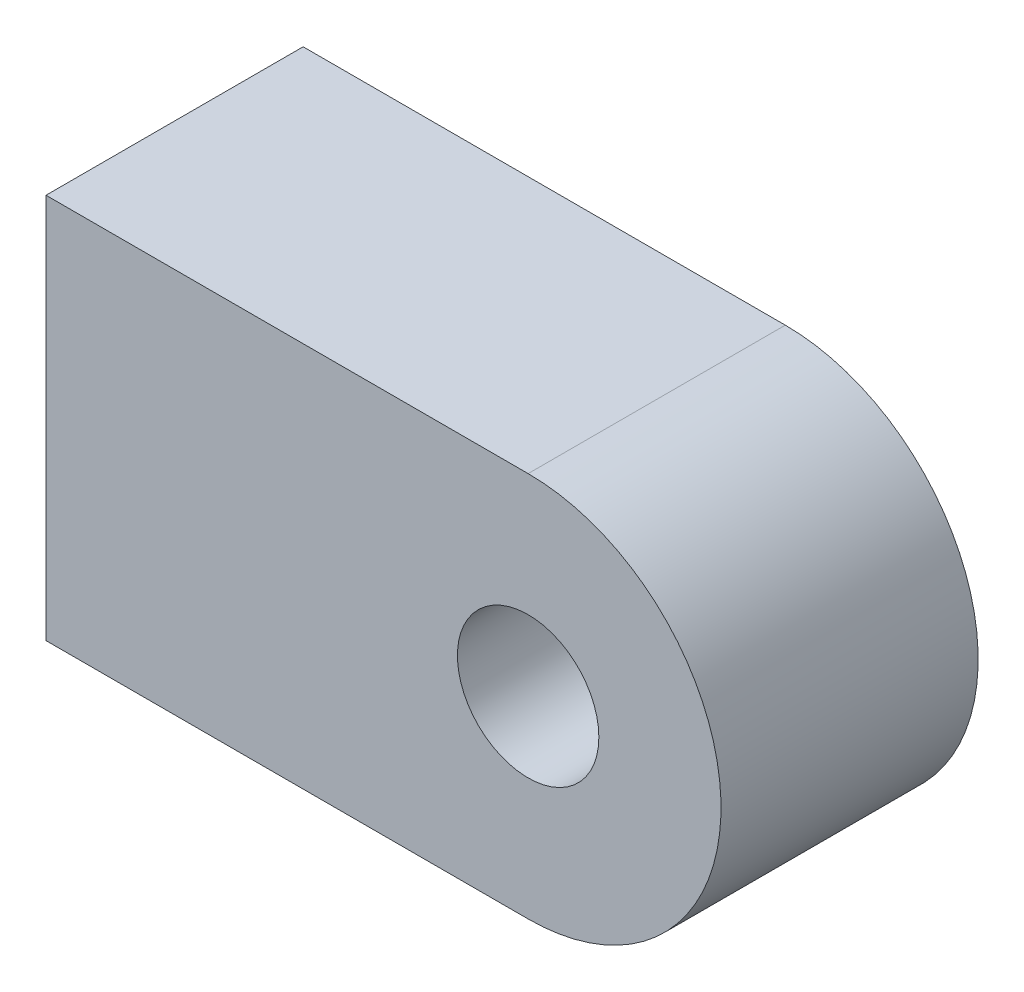
ISO-10303-21;
HEADER;
FILE_DESCRIPTION(('STEP AP214'),'2;1');
FILE_NAME('part.step','',(''),(''),'','','');
FILE_SCHEMA(('AUTOMOTIVE_DESIGN { 1 0 10303 214 1 1 1 1 }'));
ENDSEC;
DATA;
#1=APPLICATION_CONTEXT('core data for automotive mechanical design processes');
#2=APPLICATION_PROTOCOL_DEFINITION('international standard','automotive_design',2000,#1);
#3=PRODUCT_CONTEXT('',#1,'mechanical');
#4=PRODUCT('Part','Part','',(#3));
#5=PRODUCT_RELATED_PRODUCT_CATEGORY('part','',(#4));
#6=PRODUCT_DEFINITION_FORMATION('','',#4);
#7=PRODUCT_DEFINITION_CONTEXT('part definition',#1,'design');
#8=PRODUCT_DEFINITION('design','',#6,#7);
#9=PRODUCT_DEFINITION_SHAPE('','',#8);
#10=(LENGTH_UNIT() NAMED_UNIT(*) SI_UNIT(.MILLI.,.METRE.));
#11=(NAMED_UNIT(*) PLANE_ANGLE_UNIT() SI_UNIT($,.RADIAN.));
#12=(NAMED_UNIT(*) SI_UNIT($,.STERADIAN.) SOLID_ANGLE_UNIT());
#13=UNCERTAINTY_MEASURE_WITH_UNIT(LENGTH_MEASURE(1.E-05),#10,'distance_accuracy_value','');
#14=(GEOMETRIC_REPRESENTATION_CONTEXT(3) GLOBAL_UNCERTAINTY_ASSIGNED_CONTEXT((#13)) GLOBAL_UNIT_ASSIGNED_CONTEXT((#10,
#11,#12)) REPRESENTATION_CONTEXT('',''));
#15=CARTESIAN_POINT('',(0.,0.,0.));
#16=DIRECTION('',(0.,0.,1.));
#17=DIRECTION('',(1.,0.,0.));
#18=AXIS2_PLACEMENT_3D('',#15,#16,#17);
#19=CARTESIAN_POINT('',(0.,0.,10.));
#20=DIRECTION('',(0.,0.,-1.));
#21=DIRECTION('',(-1.,0.,0.));
#22=AXIS2_PLACEMENT_3D('',#19,#20,#21);
#23=PLANE('',#22);
#24=CARTESIAN_POINT('',(0.,0.,10.));
#25=DIRECTION('',(0.,0.,1.));
#26=DIRECTION('',(-1.,0.,0.));
#27=AXIS2_PLACEMENT_3D('',#24,#25,#26);
#28=CIRCLE('',#27,7.5);
#29=CARTESIAN_POINT('',(0.,-7.5,10.));
#30=VERTEX_POINT('',#29);
#31=CARTESIAN_POINT('',(0.,7.5,10.));
#32=VERTEX_POINT('',#31);
#33=EDGE_CURVE('E85',#30,#32,#28,.T.);
#34=ORIENTED_EDGE('',*,*,#33,.T.);
#35=DIRECTION('',(-1.,0.,0.));
#36=VECTOR('',#35,1.);
#37=CARTESIAN_POINT('',(-18.75,7.5,10.));
#38=LINE('',#37,#36);
#39=CARTESIAN_POINT('',(-18.75,7.5,10.));
#40=VERTEX_POINT('',#39);
#41=EDGE_CURVE('E80',#32,#40,#38,.T.);
#42=ORIENTED_EDGE('',*,*,#41,.T.);
#43=DIRECTION('',(0.,-1.,0.));
#44=VECTOR('',#43,1.);
#45=CARTESIAN_POINT('',(-18.75,-7.5,10.));
#46=LINE('',#45,#44);
#47=CARTESIAN_POINT('',(-18.75,-7.5,10.));
#48=VERTEX_POINT('',#47);
#49=EDGE_CURVE('E83',#40,#48,#46,.T.);
#50=ORIENTED_EDGE('',*,*,#49,.T.);
#51=DIRECTION('',(1.,0.,0.));
#52=VECTOR('',#51,1.);
#53=CARTESIAN_POINT('',(0.,-7.5,10.));
#54=LINE('',#53,#52);
#55=EDGE_CURVE('E50',#48,#30,#54,.T.);
#56=ORIENTED_EDGE('',*,*,#55,.T.);
#57=EDGE_LOOP('',(#34,#42,#50,#56));
#58=FACE_BOUND('',#57,.T.);
#59=CARTESIAN_POINT('',(0.,0.,10.));
#60=DIRECTION('',(0.,0.,1.));
#61=DIRECTION('',(1.,0.,0.));
#62=AXIS2_PLACEMENT_3D('',#59,#60,#61);
#63=CIRCLE('',#62,2.75);
#64=CARTESIAN_POINT('',(2.75,0.,10.));
#65=VERTEX_POINT('',#64);
#66=EDGE_CURVE('E100',#65,#65,#63,.T.);
#67=ORIENTED_EDGE('',*,*,#66,.F.);
#68=EDGE_LOOP('',(#67));
#69=FACE_BOUND('',#68,.T.);
#70=ADVANCED_FACE('F33',(#58,#69),#23,.F.);
#71=CARTESIAN_POINT('',(0.,0.,0.));
#72=DIRECTION('',(0.,0.,-1.));
#73=DIRECTION('',(-1.,0.,0.));
#74=AXIS2_PLACEMENT_3D('',#71,#72,#73);
#75=PLANE('',#74);
#76=CARTESIAN_POINT('',(0.,0.,0.));
#77=DIRECTION('',(0.,0.,1.));
#78=DIRECTION('',(-1.,0.,0.));
#79=AXIS2_PLACEMENT_3D('',#76,#77,#78);
#80=CIRCLE('',#79,7.5);
#81=CARTESIAN_POINT('',(0.,-7.5,0.));
#82=VERTEX_POINT('',#81);
#83=CARTESIAN_POINT('',(0.,7.5,0.));
#84=VERTEX_POINT('',#83);
#85=EDGE_CURVE('E97',#82,#84,#80,.T.);
#86=ORIENTED_EDGE('',*,*,#85,.F.);
#87=DIRECTION('',(1.,0.,0.));
#88=VECTOR('',#87,1.);
#89=CARTESIAN_POINT('',(0.,-7.5,0.));
#90=LINE('',#89,#88);
#91=CARTESIAN_POINT('',(-18.75,-7.5,0.));
#92=VERTEX_POINT('',#91);
#93=EDGE_CURVE('E73',#92,#82,#90,.T.);
#94=ORIENTED_EDGE('',*,*,#93,.F.);
#95=DIRECTION('',(0.,-1.,0.));
#96=VECTOR('',#95,1.);
#97=CARTESIAN_POINT('',(-18.75,-7.5,0.));
#98=LINE('',#97,#96);
#99=CARTESIAN_POINT('',(-18.75,7.5,0.));
#100=VERTEX_POINT('',#99);
#101=EDGE_CURVE('E67',#100,#92,#98,.T.);
#102=ORIENTED_EDGE('',*,*,#101,.F.);
#103=DIRECTION('',(-1.,0.,0.));
#104=VECTOR('',#103,1.);
#105=CARTESIAN_POINT('',(-18.75,7.5,0.));
#106=LINE('',#105,#104);
#107=EDGE_CURVE('E89',#84,#100,#106,.T.);
#108=ORIENTED_EDGE('',*,*,#107,.F.);
#109=EDGE_LOOP('',(#86,#94,#102,#108));
#110=FACE_BOUND('',#109,.T.);
#111=CARTESIAN_POINT('',(0.,0.,0.));
#112=DIRECTION('',(0.,0.,1.));
#113=DIRECTION('',(1.,0.,0.));
#114=AXIS2_PLACEMENT_3D('',#111,#112,#113);
#115=CIRCLE('',#114,2.75);
#116=CARTESIAN_POINT('',(2.75,0.,0.));
#117=VERTEX_POINT('',#116);
#118=EDGE_CURVE('E112',#117,#117,#115,.T.);
#119=ORIENTED_EDGE('',*,*,#118,.T.);
#120=EDGE_LOOP('',(#119));
#121=FACE_BOUND('',#120,.T.);
#122=ADVANCED_FACE('F108',(#110,#121),#75,.T.);
#123=CARTESIAN_POINT('',(0.,0.,10.));
#124=DIRECTION('',(0.,0.,-1.));
#125=DIRECTION('',(-1.,0.,0.));
#126=AXIS2_PLACEMENT_3D('',#123,#124,#125);
#127=CYLINDRICAL_SURFACE('',#126,7.5);
#128=ORIENTED_EDGE('',*,*,#85,.T.);
#129=DIRECTION('',(0.,0.,-1.));
#130=VECTOR('',#129,1.);
#131=CARTESIAN_POINT('',(0.,7.5,10.));
#132=LINE('',#131,#130);
#133=EDGE_CURVE('E11',#32,#84,#132,.T.);
#134=ORIENTED_EDGE('',*,*,#133,.F.);
#135=ORIENTED_EDGE('',*,*,#33,.F.);
#136=DIRECTION('',(0.,0.,-1.));
#137=VECTOR('',#136,1.);
#138=CARTESIAN_POINT('',(0.,-7.5,10.));
#139=LINE('',#138,#137);
#140=EDGE_CURVE('E93',#30,#82,#139,.T.);
#141=ORIENTED_EDGE('',*,*,#140,.T.);
#142=EDGE_LOOP('',(#128,#134,#135,#141));
#143=FACE_BOUND('',#142,.T.);
#144=ADVANCED_FACE('F35',(#143),#127,.T.);
#145=CARTESIAN_POINT('',(-18.75,7.5,10.));
#146=DIRECTION('',(0.,-1.,0.));
#147=DIRECTION('',(1.,0.,0.));
#148=AXIS2_PLACEMENT_3D('',#145,#146,#147);
#149=PLANE('',#148);
#150=ORIENTED_EDGE('',*,*,#107,.T.);
#151=DIRECTION('',(0.,0.,-1.));
#152=VECTOR('',#151,1.);
#153=CARTESIAN_POINT('',(-18.75,7.5,10.));
#154=LINE('',#153,#152);
#155=EDGE_CURVE('E42',#40,#100,#154,.T.);
#156=ORIENTED_EDGE('',*,*,#155,.F.);
#157=ORIENTED_EDGE('',*,*,#41,.F.);
#158=ORIENTED_EDGE('',*,*,#133,.T.);
#159=EDGE_LOOP('',(#150,#156,#157,#158));
#160=FACE_BOUND('',#159,.T.);
#161=ADVANCED_FACE('F88',(#160),#149,.F.);
#162=CARTESIAN_POINT('',(-18.75,-7.5,10.));
#163=DIRECTION('',(1.,0.,0.));
#164=DIRECTION('',(0.,1.,0.));
#165=AXIS2_PLACEMENT_3D('',#162,#163,#164);
#166=PLANE('',#165);
#167=ORIENTED_EDGE('',*,*,#101,.T.);
#168=DIRECTION('',(0.,0.,-1.));
#169=VECTOR('',#168,1.);
#170=CARTESIAN_POINT('',(-18.75,-7.5,10.));
#171=LINE('',#170,#169);
#172=EDGE_CURVE('E90',#48,#92,#171,.T.);
#173=ORIENTED_EDGE('',*,*,#172,.F.);
#174=ORIENTED_EDGE('',*,*,#49,.F.);
#175=ORIENTED_EDGE('',*,*,#155,.T.);
#176=EDGE_LOOP('',(#167,#173,#174,#175));
#177=FACE_BOUND('',#176,.T.);
#178=ADVANCED_FACE('F91',(#177),#166,.F.);
#179=CARTESIAN_POINT('',(0.,-7.5,10.));
#180=DIRECTION('',(0.,1.,0.));
#181=DIRECTION('',(-1.,0.,0.));
#182=AXIS2_PLACEMENT_3D('',#179,#180,#181);
#183=PLANE('',#182);
#184=ORIENTED_EDGE('',*,*,#93,.T.);
#185=ORIENTED_EDGE('',*,*,#140,.F.);
#186=ORIENTED_EDGE('',*,*,#55,.F.);
#187=ORIENTED_EDGE('',*,*,#172,.T.);
#188=EDGE_LOOP('',(#184,#185,#186,#187));
#189=FACE_BOUND('',#188,.T.);
#190=ADVANCED_FACE('F105',(#189),#183,.F.);
#191=CARTESIAN_POINT('',(0.,0.,10.));
#192=DIRECTION('',(0.,0.,-1.));
#193=DIRECTION('',(-1.,0.,0.));
#194=AXIS2_PLACEMENT_3D('',#191,#192,#193);
#195=CYLINDRICAL_SURFACE('',#194,2.75);
#196=ORIENTED_EDGE('',*,*,#66,.T.);
#197=EDGE_LOOP('',(#196));
#198=FACE_BOUND('',#197,.T.);
#199=ORIENTED_EDGE('',*,*,#118,.F.);
#200=EDGE_LOOP('',(#199));
#201=FACE_BOUND('',#200,.T.);
#202=ADVANCED_FACE('F118',(#198,#201),#195,.F.);
#203=CLOSED_SHELL('',(#70,#122,#144,#161,#178,#190,#202));
#204=MANIFOLD_SOLID_BREP('B2',#203);
#205=ADVANCED_BREP_SHAPE_REPRESENTATION('',(#18,#204),#14);
#206=SHAPE_DEFINITION_REPRESENTATION(#9,#205);
ENDSEC;
END-ISO-10303-21;
